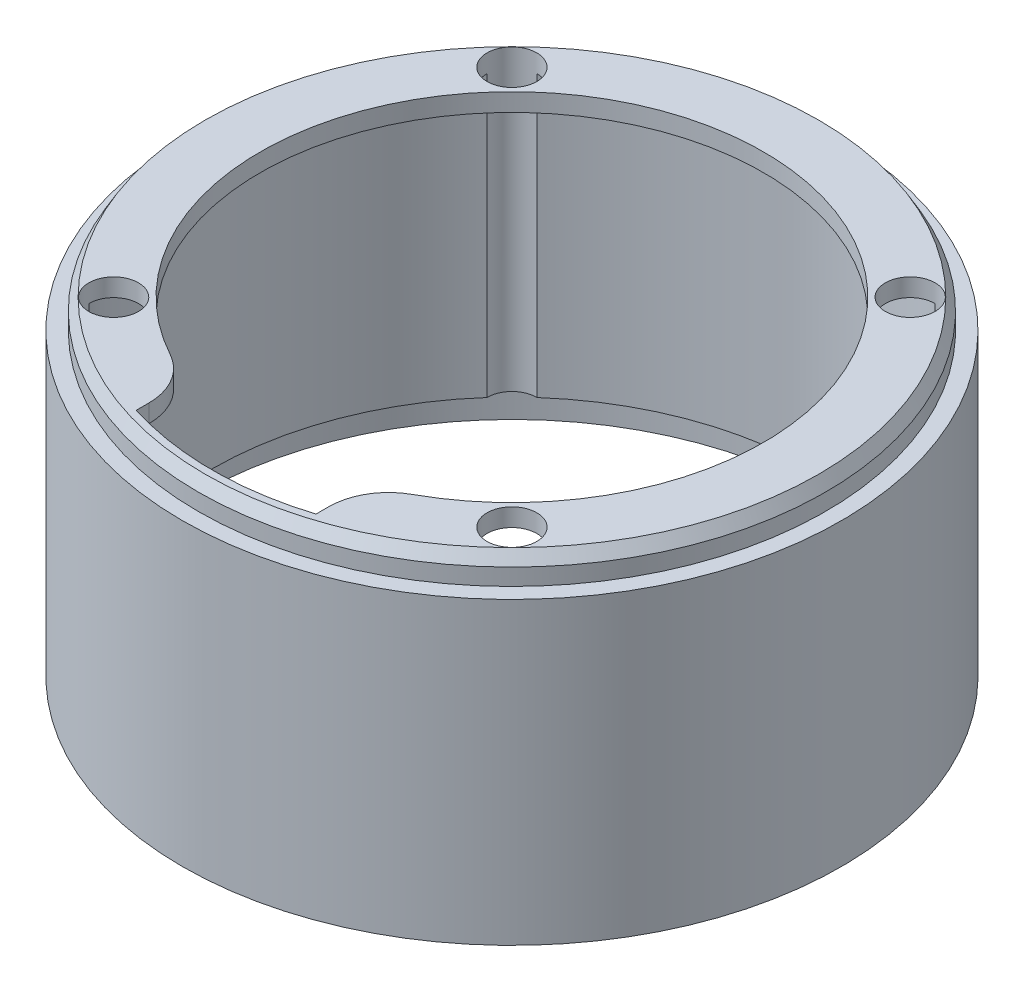
ISO-10303-21;
HEADER;
FILE_DESCRIPTION(('STEP AP214'),'2;1');
FILE_NAME('part.step','',(''),(''),'','','');
FILE_SCHEMA(('AUTOMOTIVE_DESIGN { 1 0 10303 214 1 1 1 1 }'));
ENDSEC;
DATA;
#1=APPLICATION_CONTEXT('core data for automotive mechanical design processes');
#2=APPLICATION_PROTOCOL_DEFINITION('international standard','automotive_design',2000,#1);
#3=PRODUCT_CONTEXT('',#1,'mechanical');
#4=PRODUCT('Part','Part','',(#3));
#5=PRODUCT_RELATED_PRODUCT_CATEGORY('part','',(#4));
#6=PRODUCT_DEFINITION_FORMATION('','',#4);
#7=PRODUCT_DEFINITION_CONTEXT('part definition',#1,'design');
#8=PRODUCT_DEFINITION('design','',#6,#7);
#9=PRODUCT_DEFINITION_SHAPE('','',#8);
#10=(LENGTH_UNIT() NAMED_UNIT(*) SI_UNIT(.MILLI.,.METRE.));
#11=(NAMED_UNIT(*) PLANE_ANGLE_UNIT() SI_UNIT($,.RADIAN.));
#12=(NAMED_UNIT(*) SI_UNIT($,.STERADIAN.) SOLID_ANGLE_UNIT());
#13=UNCERTAINTY_MEASURE_WITH_UNIT(LENGTH_MEASURE(1.E-05),#10,'distance_accuracy_value','');
#14=(GEOMETRIC_REPRESENTATION_CONTEXT(3) GLOBAL_UNCERTAINTY_ASSIGNED_CONTEXT((#13)) GLOBAL_UNIT_ASSIGNED_CONTEXT((#10,
#11,#12)) REPRESENTATION_CONTEXT('',''));
#15=CARTESIAN_POINT('',(0.,0.,0.));
#16=DIRECTION('',(0.,0.,1.));
#17=DIRECTION('',(1.,0.,0.));
#18=AXIS2_PLACEMENT_3D('',#15,#16,#17);
#19=CARTESIAN_POINT('',(0.,54.8,0.));
#20=DIRECTION('',(0.,-1.,0.));
#21=DIRECTION('',(0.,0.,-1.));
#22=AXIS2_PLACEMENT_3D('',#19,#20,#21);
#23=CYLINDRICAL_SURFACE('',#22,50.);
#24=DIRECTION('',(0.,1.,0.));
#25=VECTOR('',#24,1.);
#26=CARTESIAN_POINT('',(-33.203068739609,27.4,-37.383903304401));
#27=LINE('',#26,#25);
#28=CARTESIAN_POINT('',(-33.203068739609,5.00000000000001,-37.383903304401));
#29=VERTEX_POINT('',#28);
#30=CARTESIAN_POINT('',(-33.203068739609,51.8,-37.383903304401));
#31=VERTEX_POINT('',#30);
#32=EDGE_CURVE('E155',#29,#31,#27,.T.);
#33=ORIENTED_EDGE('',*,*,#32,.F.);
#34=CARTESIAN_POINT('',(0.,5.,0.));
#35=DIRECTION('',(0.,-1.,0.));
#36=DIRECTION('',(0.,0.,-1.));
#37=AXIS2_PLACEMENT_3D('',#34,#35,#36);
#38=CIRCLE('',#37,50.);
#39=CARTESIAN_POINT('',(33.203068739609,5.,-37.383903304401));
#40=VERTEX_POINT('',#39);
#41=EDGE_CURVE('E52',#29,#40,#38,.T.);
#42=ORIENTED_EDGE('',*,*,#41,.T.);
#43=DIRECTION('',(0.,1.,0.));
#44=VECTOR('',#43,1.);
#45=CARTESIAN_POINT('',(33.203068739609,27.4,-37.383903304401));
#46=LINE('',#45,#44);
#47=CARTESIAN_POINT('',(33.203068739609,51.8,-37.3839033044009));
#48=VERTEX_POINT('',#47);
#49=EDGE_CURVE('E160',#48,#40,#46,.F.);
#50=ORIENTED_EDGE('',*,*,#49,.F.);
#51=CARTESIAN_POINT('',(0.,51.8,0.));
#52=DIRECTION('',(0.,-1.,0.));
#53=DIRECTION('',(0.,0.,-1.));
#54=AXIS2_PLACEMENT_3D('',#51,#52,#53);
#55=CIRCLE('',#54,50.);
#56=EDGE_CURVE('E283',#31,#48,#55,.T.);
#57=ORIENTED_EDGE('',*,*,#56,.F.);
#58=EDGE_LOOP('',(#33,#42,#50,#57));
#59=FACE_BOUND('',#58,.T.);
#60=ADVANCED_FACE('F38',(#59),#23,.F.);
#61=DIRECTION('',(0.,1.,0.));
#62=VECTOR('',#61,1.);
#63=CARTESIAN_POINT('',(37.383903304401,27.4,-33.203068739609));
#64=LINE('',#63,#62);
#65=CARTESIAN_POINT('',(37.383903304401,5.,-33.203068739609));
#66=VERTEX_POINT('',#65);
#67=CARTESIAN_POINT('',(37.383903304401,51.8,-33.203068739609));
#68=VERTEX_POINT('',#67);
#69=EDGE_CURVE('E156',#66,#68,#64,.T.);
#70=ORIENTED_EDGE('',*,*,#69,.F.);
#71=CARTESIAN_POINT('',(0.,5.,0.));
#72=DIRECTION('',(0.,-1.,0.));
#73=DIRECTION('',(0.,0.,-1.));
#74=AXIS2_PLACEMENT_3D('',#71,#72,#73);
#75=CIRCLE('',#74,50.);
#76=CARTESIAN_POINT('',(37.383903304401,5.,33.203068739609));
#77=VERTEX_POINT('',#76);
#78=EDGE_CURVE('E315',#66,#77,#75,.T.);
#79=ORIENTED_EDGE('',*,*,#78,.T.);
#80=DIRECTION('',(0.,1.,0.));
#81=VECTOR('',#80,1.);
#82=CARTESIAN_POINT('',(37.383903304401,27.4,33.203068739609));
#83=LINE('',#82,#81);
#84=CARTESIAN_POINT('',(37.383903304401,51.8,33.203068739609));
#85=VERTEX_POINT('',#84);
#86=EDGE_CURVE('E266',#85,#77,#83,.F.);
#87=ORIENTED_EDGE('',*,*,#86,.F.);
#88=EDGE_CURVE('E290',#68,#85,#55,.T.);
#89=ORIENTED_EDGE('',*,*,#88,.F.);
#90=EDGE_LOOP('',(#70,#79,#87,#89));
#91=FACE_BOUND('',#90,.T.);
#92=ADVANCED_FACE('F362',(#91),#23,.F.);
#93=DIRECTION('',(0.,1.,0.));
#94=VECTOR('',#93,1.);
#95=CARTESIAN_POINT('',(33.203068739609,27.4,37.383903304401));
#96=LINE('',#95,#94);
#97=CARTESIAN_POINT('',(33.203068739609,5.,37.383903304401));
#98=VERTEX_POINT('',#97);
#99=CARTESIAN_POINT('',(33.203068739609,51.8,37.3839033044009));
#100=VERTEX_POINT('',#99);
#101=EDGE_CURVE('E270',#98,#100,#96,.T.);
#102=ORIENTED_EDGE('',*,*,#101,.F.);
#103=CARTESIAN_POINT('',(0.,5.,0.));
#104=DIRECTION('',(0.,-1.,0.));
#105=DIRECTION('',(0.,0.,-1.));
#106=AXIS2_PLACEMENT_3D('',#103,#104,#105);
#107=CIRCLE('',#106,50.);
#108=CARTESIAN_POINT('',(-33.203068739609,5.,37.383903304401));
#109=VERTEX_POINT('',#108);
#110=EDGE_CURVE('E318',#98,#109,#107,.T.);
#111=ORIENTED_EDGE('',*,*,#110,.T.);
#112=DIRECTION('',(0.,1.,0.));
#113=VECTOR('',#112,1.);
#114=CARTESIAN_POINT('',(-33.203068739609,27.4,37.383903304401));
#115=LINE('',#114,#113);
#116=CARTESIAN_POINT('',(-33.203068739609,51.8,37.383903304401));
#117=VERTEX_POINT('',#116);
#118=EDGE_CURVE('E166',#117,#109,#115,.F.);
#119=ORIENTED_EDGE('',*,*,#118,.F.);
#120=CARTESIAN_POINT('',(-15.,51.8,47.6969600708473));
#121=VERTEX_POINT('',#120);
#122=EDGE_CURVE('E289',#121,#117,#55,.T.);
#123=ORIENTED_EDGE('',*,*,#122,.F.);
#124=DIRECTION('',(0.,-1.,0.));
#125=VECTOR('',#124,1.);
#126=CARTESIAN_POINT('',(-15.,54.8,47.6969600708473));
#127=LINE('',#126,#125);
#128=CARTESIAN_POINT('',(-15.,54.8,47.6969600708473));
#129=VERTEX_POINT('',#128);
#130=EDGE_CURVE('E287',#129,#121,#127,.T.);
#131=ORIENTED_EDGE('',*,*,#130,.F.);
#132=CARTESIAN_POINT('',(0.,54.8,-3.9343528435154E-12));
#133=DIRECTION('',(0.,-1.,0.));
#134=DIRECTION('',(0.,0.,-1.));
#135=AXIS2_PLACEMENT_3D('',#132,#133,#134);
#136=CIRCLE('',#135,50.0000000000038);
#137=CARTESIAN_POINT('',(15.,54.8,47.6969600708473));
#138=VERTEX_POINT('',#137);
#139=EDGE_CURVE('E238',#138,#129,#136,.T.);
#140=ORIENTED_EDGE('',*,*,#139,.F.);
#141=DIRECTION('',(0.,-1.,0.));
#142=VECTOR('',#141,1.);
#143=CARTESIAN_POINT('',(15.,54.8,47.6969600708473));
#144=LINE('',#143,#142);
#145=CARTESIAN_POINT('',(15.,51.8,47.6969600708473));
#146=VERTEX_POINT('',#145);
#147=EDGE_CURVE('E240',#138,#146,#144,.T.);
#148=ORIENTED_EDGE('',*,*,#147,.T.);
#149=EDGE_CURVE('E291',#100,#146,#55,.T.);
#150=ORIENTED_EDGE('',*,*,#149,.F.);
#151=EDGE_LOOP('',(#102,#111,#119,#123,#131,#140,#148,#150));
#152=FACE_BOUND('',#151,.T.);
#153=ADVANCED_FACE('F302',(#152),#23,.F.);
#154=DIRECTION('',(0.,1.,0.));
#155=VECTOR('',#154,1.);
#156=CARTESIAN_POINT('',(-37.383903304401,27.4,33.203068739609));
#157=LINE('',#156,#155);
#158=CARTESIAN_POINT('',(-37.3839033044009,5.,33.203068739609));
#159=VERTEX_POINT('',#158);
#160=CARTESIAN_POINT('',(-37.3839033044009,51.8,33.203068739609));
#161=VERTEX_POINT('',#160);
#162=EDGE_CURVE('E148',#159,#161,#157,.T.);
#163=ORIENTED_EDGE('',*,*,#162,.F.);
#164=CARTESIAN_POINT('',(0.,5.,0.));
#165=DIRECTION('',(0.,-1.,0.));
#166=DIRECTION('',(0.,0.,-1.));
#167=AXIS2_PLACEMENT_3D('',#164,#165,#166);
#168=CIRCLE('',#167,50.);
#169=CARTESIAN_POINT('',(-37.383903304401,5.,-33.203068739609));
#170=VERTEX_POINT('',#169);
#171=EDGE_CURVE('E137',#159,#170,#168,.T.);
#172=ORIENTED_EDGE('',*,*,#171,.T.);
#173=DIRECTION('',(0.,1.,0.));
#174=VECTOR('',#173,1.);
#175=CARTESIAN_POINT('',(-37.383903304401,27.4,-33.203068739609));
#176=LINE('',#175,#174);
#177=CARTESIAN_POINT('',(-37.3839033044009,51.8,-33.203068739609));
#178=VERTEX_POINT('',#177);
#179=EDGE_CURVE('E146',#178,#170,#176,.F.);
#180=ORIENTED_EDGE('',*,*,#179,.F.);
#181=EDGE_CURVE('E286',#161,#178,#55,.T.);
#182=ORIENTED_EDGE('',*,*,#181,.F.);
#183=EDGE_LOOP('',(#163,#172,#180,#182));
#184=FACE_BOUND('',#183,.T.);
#185=ADVANCED_FACE('F144',(#184),#23,.F.);
#186=CARTESIAN_POINT('',(-33.2340187157677,0.,33.2340187157678));
#187=DIRECTION('',(0.,1.,0.));
#188=DIRECTION('',(0.,0.,1.));
#189=AXIS2_PLACEMENT_3D('',#186,#187,#188);
#190=CYLINDRICAL_SURFACE('',#189,4.15);
#191=CARTESIAN_POINT('',(-33.2340187157677,54.8,33.2340187157678));
#192=DIRECTION('',(0.,1.,0.));
#193=DIRECTION('',(0.,0.,1.));
#194=AXIS2_PLACEMENT_3D('',#191,#192,#193);
#195=CIRCLE('',#194,4.15);
#196=CARTESIAN_POINT('',(-33.2340187157677,54.8,37.3840187157678));
#197=VERTEX_POINT('',#196);
#198=EDGE_CURVE('E158',#197,#197,#195,.T.);
#199=ORIENTED_EDGE('',*,*,#198,.T.);
#200=EDGE_LOOP('',(#199));
#201=FACE_BOUND('',#200,.T.);
#202=CARTESIAN_POINT('',(-33.2340187157677,5.,33.2340187157678));
#203=DIRECTION('',(0.,-1.,0.));
#204=DIRECTION('',(0.,0.,-1.));
#205=AXIS2_PLACEMENT_3D('',#202,#203,#204);
#206=CIRCLE('',#205,4.15);
#207=EDGE_CURVE('E320',#159,#109,#206,.F.);
#208=ORIENTED_EDGE('',*,*,#207,.F.);
#209=ORIENTED_EDGE('',*,*,#162,.T.);
#210=CARTESIAN_POINT('',(-33.2340187157677,51.8,33.2340187157678));
#211=DIRECTION('',(0.,-1.,0.));
#212=DIRECTION('',(0.,0.,-1.));
#213=AXIS2_PLACEMENT_3D('',#210,#211,#212);
#214=CIRCLE('',#213,4.15);
#215=EDGE_CURVE('E257',#117,#161,#214,.F.);
#216=ORIENTED_EDGE('',*,*,#215,.F.);
#217=ORIENTED_EDGE('',*,*,#118,.T.);
#218=EDGE_LOOP('',(#208,#209,#216,#217));
#219=FACE_BOUND('',#218,.T.);
#220=ADVANCED_FACE('F370',(#201,#219),#190,.F.);
#221=CARTESIAN_POINT('',(33.2340187157678,0.,33.2340187157677));
#222=DIRECTION('',(0.,1.,0.));
#223=DIRECTION('',(0.,0.,1.));
#224=AXIS2_PLACEMENT_3D('',#221,#222,#223);
#225=CYLINDRICAL_SURFACE('',#224,4.15);
#226=CARTESIAN_POINT('',(33.2340187157678,54.8,33.2340187157677));
#227=DIRECTION('',(0.,1.,0.));
#228=DIRECTION('',(0.,0.,1.));
#229=AXIS2_PLACEMENT_3D('',#226,#227,#228);
#230=CIRCLE('',#229,4.15);
#231=CARTESIAN_POINT('',(33.2340187157678,54.8,37.3840187157677));
#232=VERTEX_POINT('',#231);
#233=EDGE_CURVE('E224',#232,#232,#230,.T.);
#234=ORIENTED_EDGE('',*,*,#233,.T.);
#235=EDGE_LOOP('',(#234));
#236=FACE_BOUND('',#235,.T.);
#237=CARTESIAN_POINT('',(33.2340187157678,5.,33.2340187157677));
#238=DIRECTION('',(0.,-1.,0.));
#239=DIRECTION('',(0.,0.,-1.));
#240=AXIS2_PLACEMENT_3D('',#237,#238,#239);
#241=CIRCLE('',#240,4.15);
#242=EDGE_CURVE('E313',#98,#77,#241,.F.);
#243=ORIENTED_EDGE('',*,*,#242,.F.);
#244=ORIENTED_EDGE('',*,*,#101,.T.);
#245=CARTESIAN_POINT('',(33.2340187157678,51.8,33.2340187157677));
#246=DIRECTION('',(0.,-1.,0.));
#247=DIRECTION('',(0.,0.,-1.));
#248=AXIS2_PLACEMENT_3D('',#245,#246,#247);
#249=CIRCLE('',#248,4.15);
#250=EDGE_CURVE('E261',#85,#100,#249,.F.);
#251=ORIENTED_EDGE('',*,*,#250,.F.);
#252=ORIENTED_EDGE('',*,*,#86,.T.);
#253=EDGE_LOOP('',(#243,#244,#251,#252));
#254=FACE_BOUND('',#253,.T.);
#255=ADVANCED_FACE('F375',(#236,#254),#225,.F.);
#256=CARTESIAN_POINT('',(33.2340187157678,0.,-33.2340187157677));
#257=DIRECTION('',(0.,1.,0.));
#258=DIRECTION('',(0.,0.,1.));
#259=AXIS2_PLACEMENT_3D('',#256,#257,#258);
#260=CYLINDRICAL_SURFACE('',#259,4.15);
#261=CARTESIAN_POINT('',(33.2340187157678,54.8,-33.2340187157677));
#262=DIRECTION('',(0.,1.,0.));
#263=DIRECTION('',(0.,0.,1.));
#264=AXIS2_PLACEMENT_3D('',#261,#262,#263);
#265=CIRCLE('',#264,4.15);
#266=CARTESIAN_POINT('',(33.2340187157678,54.8,-29.0840187157677));
#267=VERTEX_POINT('',#266);
#268=EDGE_CURVE('E228',#267,#267,#265,.T.);
#269=ORIENTED_EDGE('',*,*,#268,.T.);
#270=EDGE_LOOP('',(#269));
#271=FACE_BOUND('',#270,.T.);
#272=CARTESIAN_POINT('',(33.2340187157678,5.,-33.2340187157677));
#273=DIRECTION('',(0.,-1.,0.));
#274=DIRECTION('',(0.,0.,-1.));
#275=AXIS2_PLACEMENT_3D('',#272,#273,#274);
#276=CIRCLE('',#275,4.15);
#277=EDGE_CURVE('E276',#66,#40,#276,.F.);
#278=ORIENTED_EDGE('',*,*,#277,.F.);
#279=ORIENTED_EDGE('',*,*,#69,.T.);
#280=CARTESIAN_POINT('',(33.2340187157678,51.8,-33.2340187157677));
#281=DIRECTION('',(0.,-1.,0.));
#282=DIRECTION('',(0.,0.,-1.));
#283=AXIS2_PLACEMENT_3D('',#280,#281,#282);
#284=CIRCLE('',#283,4.15);
#285=EDGE_CURVE('E279',#48,#68,#284,.F.);
#286=ORIENTED_EDGE('',*,*,#285,.F.);
#287=ORIENTED_EDGE('',*,*,#49,.T.);
#288=EDGE_LOOP('',(#278,#279,#286,#287));
#289=FACE_BOUND('',#288,.T.);
#290=ADVANCED_FACE('F275',(#271,#289),#260,.F.);
#291=CARTESIAN_POINT('',(-33.2340187157677,0.,-33.2340187157678));
#292=DIRECTION('',(0.,1.,0.));
#293=DIRECTION('',(0.,0.,1.));
#294=AXIS2_PLACEMENT_3D('',#291,#292,#293);
#295=CYLINDRICAL_SURFACE('',#294,4.15);
#296=CARTESIAN_POINT('',(-33.2340187157677,54.8,-33.2340187157678));
#297=DIRECTION('',(0.,1.,0.));
#298=DIRECTION('',(0.,0.,1.));
#299=AXIS2_PLACEMENT_3D('',#296,#297,#298);
#300=CIRCLE('',#299,4.15);
#301=CARTESIAN_POINT('',(-33.2340187157677,54.8,-29.0840187157678));
#302=VERTEX_POINT('',#301);
#303=EDGE_CURVE('E231',#302,#302,#300,.T.);
#304=ORIENTED_EDGE('',*,*,#303,.T.);
#305=EDGE_LOOP('',(#304));
#306=FACE_BOUND('',#305,.T.);
#307=CARTESIAN_POINT('',(-33.2340187157677,5.,-33.2340187157678));
#308=DIRECTION('',(0.,-1.,0.));
#309=DIRECTION('',(0.,0.,-1.));
#310=AXIS2_PLACEMENT_3D('',#307,#308,#309);
#311=CIRCLE('',#310,4.15);
#312=EDGE_CURVE('E12',#29,#170,#311,.F.);
#313=ORIENTED_EDGE('',*,*,#312,.F.);
#314=ORIENTED_EDGE('',*,*,#32,.T.);
#315=CARTESIAN_POINT('',(-33.2340187157677,51.8,-33.2340187157678));
#316=DIRECTION('',(0.,-1.,0.));
#317=DIRECTION('',(0.,0.,-1.));
#318=AXIS2_PLACEMENT_3D('',#315,#316,#317);
#319=CIRCLE('',#318,4.15);
#320=EDGE_CURVE('E154',#178,#31,#319,.F.);
#321=ORIENTED_EDGE('',*,*,#320,.F.);
#322=ORIENTED_EDGE('',*,*,#179,.T.);
#323=EDGE_LOOP('',(#313,#314,#321,#322));
#324=FACE_BOUND('',#323,.T.);
#325=ADVANCED_FACE('F152',(#306,#324),#295,.F.);
#326=CARTESIAN_POINT('',(0.,54.8,0.));
#327=DIRECTION('',(0.,-1.,0.));
#328=DIRECTION('',(0.,0.,-1.));
#329=AXIS2_PLACEMENT_3D('',#326,#327,#328);
#330=CYLINDRICAL_SURFACE('',#329,55.);
#331=CARTESIAN_POINT('',(0.,0.,0.));
#332=DIRECTION('',(0.,1.,0.));
#333=DIRECTION('',(0.,0.,1.));
#334=AXIS2_PLACEMENT_3D('',#331,#332,#333);
#335=CIRCLE('',#334,55.);
#336=CARTESIAN_POINT('',(0.,0.,55.));
#337=VERTEX_POINT('',#336);
#338=EDGE_CURVE('E173',#337,#337,#335,.T.);
#339=ORIENTED_EDGE('',*,*,#338,.T.);
#340=EDGE_LOOP('',(#339));
#341=FACE_BOUND('',#340,.T.);
#342=CARTESIAN_POINT('',(0.,50.,0.));
#343=DIRECTION('',(0.,1.,0.));
#344=DIRECTION('',(0.,0.,1.));
#345=AXIS2_PLACEMENT_3D('',#342,#343,#344);
#346=CIRCLE('',#345,55.);
#347=CARTESIAN_POINT('',(0.,50.,55.));
#348=VERTEX_POINT('',#347);
#349=EDGE_CURVE('E197',#348,#348,#346,.T.);
#350=ORIENTED_EDGE('',*,*,#349,.F.);
#351=EDGE_LOOP('',(#350));
#352=FACE_BOUND('',#351,.T.);
#353=ADVANCED_FACE('F217',(#341,#352),#330,.T.);
#354=CARTESIAN_POINT('',(0.,54.8,0.));
#355=DIRECTION('',(0.,1.,0.));
#356=DIRECTION('',(0.,0.,1.));
#357=AXIS2_PLACEMENT_3D('',#354,#355,#356);
#358=PLANE('',#357);
#359=CARTESIAN_POINT('',(0.,54.8,0.));
#360=DIRECTION('',(0.,1.,0.));
#361=DIRECTION('',(0.,0.,1.));
#362=AXIS2_PLACEMENT_3D('',#359,#360,#361);
#363=CIRCLE('',#362,51.1952994616208);
#364=CARTESIAN_POINT('',(0.,54.8,51.1952994616208));
#365=VERTEX_POINT('',#364);
#366=EDGE_CURVE('E196',#365,#365,#363,.T.);
#367=ORIENTED_EDGE('',*,*,#366,.T.);
#368=EDGE_LOOP('',(#367));
#369=FACE_BOUND('',#368,.T.);
#370=ORIENTED_EDGE('',*,*,#198,.F.);
#371=EDGE_LOOP('',(#370));
#372=FACE_BOUND('',#371,.T.);
#373=ORIENTED_EDGE('',*,*,#233,.F.);
#374=EDGE_LOOP('',(#373));
#375=FACE_BOUND('',#374,.T.);
#376=ORIENTED_EDGE('',*,*,#268,.F.);
#377=EDGE_LOOP('',(#376));
#378=FACE_BOUND('',#377,.T.);
#379=ORIENTED_EDGE('',*,*,#303,.F.);
#380=EDGE_LOOP('',(#379));
#381=FACE_BOUND('',#380,.T.);
#382=DIRECTION('',(0.,0.,-1.));
#383=VECTOR('',#382,1.);
#384=CARTESIAN_POINT('',(-15.,54.8,33.2340187157678));
#385=LINE('',#384,#383);
#386=CARTESIAN_POINT('',(-15.,54.8,45.596052460712));
#387=VERTEX_POINT('',#386);
#388=EDGE_CURVE('E235',#129,#387,#385,.T.);
#389=ORIENTED_EDGE('',*,*,#388,.T.);
#390=CARTESIAN_POINT('',(-25.,54.8,45.596052460712));
#391=DIRECTION('',(0.,1.,0.));
#392=DIRECTION('',(0.,0.,1.));
#393=AXIS2_PLACEMENT_3D('',#390,#391,#392);
#394=CIRCLE('',#393,10.);
#395=CARTESIAN_POINT('',(-20.1923076923077,54.8,36.827580833652));
#396=VERTEX_POINT('',#395);
#397=EDGE_CURVE('E192',#387,#396,#394,.T.);
#398=ORIENTED_EDGE('',*,*,#397,.T.);
#399=CARTESIAN_POINT('',(0.,54.8,0.));
#400=DIRECTION('',(0.,1.,0.));
#401=DIRECTION('',(0.,0.,1.));
#402=AXIS2_PLACEMENT_3D('',#399,#400,#401);
#403=CIRCLE('',#402,42.);
#404=CARTESIAN_POINT('',(20.1923076923077,54.8,36.827580833652));
#405=VERTEX_POINT('',#404);
#406=EDGE_CURVE('E170',#405,#396,#403,.T.);
#407=ORIENTED_EDGE('',*,*,#406,.F.);
#408=CARTESIAN_POINT('',(25.,54.8,45.596052460712));
#409=DIRECTION('',(0.,1.,0.));
#410=DIRECTION('',(0.,0.,1.));
#411=AXIS2_PLACEMENT_3D('',#408,#409,#410);
#412=CIRCLE('',#411,10.);
#413=CARTESIAN_POINT('',(15.,54.8,45.596052460712));
#414=VERTEX_POINT('',#413);
#415=EDGE_CURVE('E60',#405,#414,#412,.T.);
#416=ORIENTED_EDGE('',*,*,#415,.T.);
#417=DIRECTION('',(0.,0.,1.));
#418=VECTOR('',#417,1.);
#419=CARTESIAN_POINT('',(15.,54.8,33.2340187157678));
#420=LINE('',#419,#418);
#421=EDGE_CURVE('E307',#414,#138,#420,.T.);
#422=ORIENTED_EDGE('',*,*,#421,.T.);
#423=ORIENTED_EDGE('',*,*,#139,.T.);
#424=EDGE_LOOP('',(#389,#398,#407,#416,#422,#423));
#425=FACE_BOUND('',#424,.T.);
#426=ADVANCED_FACE('F213',(#369,#372,#375,#378,#381,#425),#358,.T.);
#427=CARTESIAN_POINT('',(0.,0.,0.));
#428=DIRECTION('',(0.,1.,0.));
#429=DIRECTION('',(0.,0.,1.));
#430=AXIS2_PLACEMENT_3D('',#427,#428,#429);
#431=CYLINDRICAL_SURFACE('',#430,42.);
#432=ORIENTED_EDGE('',*,*,#406,.T.);
#433=DIRECTION('',(0.,1.,0.));
#434=VECTOR('',#433,1.);
#435=CARTESIAN_POINT('',(-20.1923076923077,0.,36.827580833652));
#436=LINE('',#435,#434);
#437=CARTESIAN_POINT('',(-20.1923076923077,51.8,36.827580833652));
#438=VERTEX_POINT('',#437);
#439=EDGE_CURVE('E182',#396,#438,#436,.F.);
#440=ORIENTED_EDGE('',*,*,#439,.T.);
#441=CARTESIAN_POINT('',(0.,51.8,0.));
#442=DIRECTION('',(0.,-1.,0.));
#443=DIRECTION('',(0.,0.,-1.));
#444=AXIS2_PLACEMENT_3D('',#441,#442,#443);
#445=CIRCLE('',#444,42.);
#446=CARTESIAN_POINT('',(20.1923076923077,51.8,36.827580833652));
#447=VERTEX_POINT('',#446);
#448=EDGE_CURVE('E249',#447,#438,#445,.F.);
#449=ORIENTED_EDGE('',*,*,#448,.F.);
#450=DIRECTION('',(0.,1.,0.));
#451=VECTOR('',#450,1.);
#452=CARTESIAN_POINT('',(20.1923076923077,0.,36.827580833652));
#453=LINE('',#452,#451);
#454=EDGE_CURVE('E179',#447,#405,#453,.T.);
#455=ORIENTED_EDGE('',*,*,#454,.T.);
#456=EDGE_LOOP('',(#432,#440,#449,#455));
#457=FACE_BOUND('',#456,.T.);
#458=ADVANCED_FACE('F216',(#457),#431,.F.);
#459=CARTESIAN_POINT('',(0.,0.,0.));
#460=DIRECTION('',(0.,1.,0.));
#461=DIRECTION('',(0.,0.,1.));
#462=AXIS2_PLACEMENT_3D('',#459,#460,#461);
#463=PLANE('',#462);
#464=CARTESIAN_POINT('',(0.,0.,0.));
#465=DIRECTION('',(0.,-1.,0.));
#466=DIRECTION('',(0.,0.,-1.));
#467=AXIS2_PLACEMENT_3D('',#464,#465,#466);
#468=CIRCLE('',#467,52.5);
#469=CARTESIAN_POINT('',(0.,0.,-52.5));
#470=VERTEX_POINT('',#469);
#471=EDGE_CURVE('E324',#470,#470,#468,.T.);
#472=ORIENTED_EDGE('',*,*,#471,.F.);
#473=EDGE_LOOP('',(#472));
#474=FACE_BOUND('',#473,.T.);
#475=ORIENTED_EDGE('',*,*,#338,.F.);
#476=EDGE_LOOP('',(#475));
#477=FACE_BOUND('',#476,.T.);
#478=ADVANCED_FACE('F337',(#474,#477),#463,.F.);
#479=CARTESIAN_POINT('',(0.,51.8,0.));
#480=DIRECTION('',(0.,-1.,0.));
#481=DIRECTION('',(0.,0.,-1.));
#482=AXIS2_PLACEMENT_3D('',#479,#480,#481);
#483=PLANE('',#482);
#484=ORIENTED_EDGE('',*,*,#448,.T.);
#485=CARTESIAN_POINT('',(-25.,51.8,45.596052460712));
#486=DIRECTION('',(0.,-1.,0.));
#487=DIRECTION('',(0.,0.,-1.));
#488=AXIS2_PLACEMENT_3D('',#485,#486,#487);
#489=CIRCLE('',#488,10.);
#490=CARTESIAN_POINT('',(-15.,51.8,45.596052460712));
#491=VERTEX_POINT('',#490);
#492=EDGE_CURVE('E187',#438,#491,#489,.T.);
#493=ORIENTED_EDGE('',*,*,#492,.T.);
#494=DIRECTION('',(0.,0.,-1.));
#495=VECTOR('',#494,1.);
#496=CARTESIAN_POINT('',(-15.,51.8,33.2340187157678));
#497=LINE('',#496,#495);
#498=EDGE_CURVE('E200',#121,#491,#497,.T.);
#499=ORIENTED_EDGE('',*,*,#498,.F.);
#500=ORIENTED_EDGE('',*,*,#122,.T.);
#501=ORIENTED_EDGE('',*,*,#215,.T.);
#502=ORIENTED_EDGE('',*,*,#181,.T.);
#503=ORIENTED_EDGE('',*,*,#320,.T.);
#504=ORIENTED_EDGE('',*,*,#56,.T.);
#505=ORIENTED_EDGE('',*,*,#285,.T.);
#506=ORIENTED_EDGE('',*,*,#88,.T.);
#507=ORIENTED_EDGE('',*,*,#250,.T.);
#508=ORIENTED_EDGE('',*,*,#149,.T.);
#509=DIRECTION('',(0.,0.,1.));
#510=VECTOR('',#509,1.);
#511=CARTESIAN_POINT('',(15.,51.8,0.));
#512=LINE('',#511,#510);
#513=CARTESIAN_POINT('',(15.,51.8,45.596052460712));
#514=VERTEX_POINT('',#513);
#515=EDGE_CURVE('E177',#514,#146,#512,.T.);
#516=ORIENTED_EDGE('',*,*,#515,.F.);
#517=CARTESIAN_POINT('',(25.,51.8,45.596052460712));
#518=DIRECTION('',(0.,-1.,0.));
#519=DIRECTION('',(0.,0.,-1.));
#520=AXIS2_PLACEMENT_3D('',#517,#518,#519);
#521=CIRCLE('',#520,10.);
#522=EDGE_CURVE('E185',#514,#447,#521,.T.);
#523=ORIENTED_EDGE('',*,*,#522,.T.);
#524=EDGE_LOOP('',(#484,#493,#499,#500,#501,#502,#503,#504,#505,#506,#507,#508,#516,#523));
#525=FACE_BOUND('',#524,.T.);
#526=ADVANCED_FACE('F252',(#525),#483,.T.);
#527=CARTESIAN_POINT('',(-15.,54.8,33.2340187157678));
#528=DIRECTION('',(-1.,0.,0.));
#529=DIRECTION('',(0.,0.,1.));
#530=AXIS2_PLACEMENT_3D('',#527,#528,#529);
#531=PLANE('',#530);
#532=ORIENTED_EDGE('',*,*,#498,.T.);
#533=DIRECTION('',(0.,1.,0.));
#534=VECTOR('',#533,1.);
#535=CARTESIAN_POINT('',(-15.,54.8,45.596052460712));
#536=LINE('',#535,#534);
#537=EDGE_CURVE('E189',#491,#387,#536,.T.);
#538=ORIENTED_EDGE('',*,*,#537,.T.);
#539=ORIENTED_EDGE('',*,*,#388,.F.);
#540=ORIENTED_EDGE('',*,*,#130,.T.);
#541=EDGE_LOOP('',(#532,#538,#539,#540));
#542=FACE_BOUND('',#541,.T.);
#543=ADVANCED_FACE('F447',(#542),#531,.F.);
#544=CARTESIAN_POINT('',(15.,54.8,33.2340187157678));
#545=DIRECTION('',(1.,0.,0.));
#546=DIRECTION('',(0.,0.,-1.));
#547=AXIS2_PLACEMENT_3D('',#544,#545,#546);
#548=PLANE('',#547);
#549=ORIENTED_EDGE('',*,*,#421,.F.);
#550=DIRECTION('',(0.,1.,0.));
#551=VECTOR('',#550,1.);
#552=CARTESIAN_POINT('',(15.,54.8,45.596052460712));
#553=LINE('',#552,#551);
#554=EDGE_CURVE('E194',#414,#514,#553,.F.);
#555=ORIENTED_EDGE('',*,*,#554,.T.);
#556=ORIENTED_EDGE('',*,*,#515,.T.);
#557=ORIENTED_EDGE('',*,*,#147,.F.);
#558=EDGE_LOOP('',(#549,#555,#556,#557));
#559=FACE_BOUND('',#558,.T.);
#560=ADVANCED_FACE('F438',(#559),#548,.F.);
#561=CARTESIAN_POINT('',(-25.,0.,45.596052460712));
#562=DIRECTION('',(0.,1.,0.));
#563=DIRECTION('',(0.,0.,1.));
#564=AXIS2_PLACEMENT_3D('',#561,#562,#563);
#565=CYLINDRICAL_SURFACE('',#564,10.);
#566=ORIENTED_EDGE('',*,*,#397,.F.);
#567=ORIENTED_EDGE('',*,*,#537,.F.);
#568=ORIENTED_EDGE('',*,*,#492,.F.);
#569=ORIENTED_EDGE('',*,*,#439,.F.);
#570=EDGE_LOOP('',(#566,#567,#568,#569));
#571=FACE_BOUND('',#570,.T.);
#572=ADVANCED_FACE('F245',(#571),#565,.T.);
#573=CARTESIAN_POINT('',(25.,0.,45.596052460712));
#574=DIRECTION('',(0.,1.,0.));
#575=DIRECTION('',(0.,0.,1.));
#576=AXIS2_PLACEMENT_3D('',#573,#574,#575);
#577=CYLINDRICAL_SURFACE('',#576,10.);
#578=ORIENTED_EDGE('',*,*,#522,.F.);
#579=ORIENTED_EDGE('',*,*,#554,.F.);
#580=ORIENTED_EDGE('',*,*,#415,.F.);
#581=ORIENTED_EDGE('',*,*,#454,.F.);
#582=EDGE_LOOP('',(#578,#579,#580,#581));
#583=FACE_BOUND('',#582,.T.);
#584=ADVANCED_FACE('F350',(#583),#577,.T.);
#585=CARTESIAN_POINT('',(0.,50.,0.));
#586=DIRECTION('',(0.,1.,0.));
#587=DIRECTION('',(0.,0.,1.));
#588=AXIS2_PLACEMENT_3D('',#585,#586,#587);
#589=PLANE('',#588);
#590=CARTESIAN_POINT('',(0.,50.,0.));
#591=DIRECTION('',(0.,1.,0.));
#592=DIRECTION('',(0.,0.,1.));
#593=AXIS2_PLACEMENT_3D('',#590,#591,#592);
#594=CIRCLE('',#593,52.35);
#595=CARTESIAN_POINT('',(0.,50.,52.35));
#596=VERTEX_POINT('',#595);
#597=EDGE_CURVE('E201',#596,#596,#594,.T.);
#598=ORIENTED_EDGE('',*,*,#597,.F.);
#599=EDGE_LOOP('',(#598));
#600=FACE_BOUND('',#599,.T.);
#601=ORIENTED_EDGE('',*,*,#349,.T.);
#602=EDGE_LOOP('',(#601));
#603=FACE_BOUND('',#602,.T.);
#604=ADVANCED_FACE('F348',(#600,#603),#589,.T.);
#605=CARTESIAN_POINT('',(0.,50.,0.));
#606=DIRECTION('',(0.,1.,0.));
#607=DIRECTION('',(0.,0.,1.));
#608=AXIS2_PLACEMENT_3D('',#605,#606,#607);
#609=CYLINDRICAL_SURFACE('',#608,52.35);
#610=CARTESIAN_POINT('',(0.,52.8,0.));
#611=DIRECTION('',(0.,1.,0.));
#612=DIRECTION('',(0.,0.,1.));
#613=AXIS2_PLACEMENT_3D('',#610,#611,#612);
#614=CIRCLE('',#613,52.35);
#615=CARTESIAN_POINT('',(0.,52.8,52.35));
#616=VERTEX_POINT('',#615);
#617=EDGE_CURVE('E46',#616,#616,#614,.F.);
#618=ORIENTED_EDGE('',*,*,#617,.T.);
#619=EDGE_LOOP('',(#618));
#620=FACE_BOUND('',#619,.T.);
#621=ORIENTED_EDGE('',*,*,#597,.T.);
#622=EDGE_LOOP('',(#621));
#623=FACE_BOUND('',#622,.T.);
#624=ADVANCED_FACE('F206',(#620,#623),#609,.T.);
#625=CARTESIAN_POINT('',(0.,54.8,0.));
#626=DIRECTION('',(0.,-1.,0.));
#627=DIRECTION('',(0.,0.,-1.));
#628=AXIS2_PLACEMENT_3D('',#625,#626,#627);
#629=CONICAL_SURFACE('',#628,51.1952994616208,0.523598775598293);
#630=ORIENTED_EDGE('',*,*,#617,.F.);
#631=EDGE_LOOP('',(#630));
#632=FACE_BOUND('',#631,.T.);
#633=ORIENTED_EDGE('',*,*,#366,.F.);
#634=EDGE_LOOP('',(#633));
#635=FACE_BOUND('',#634,.T.);
#636=ADVANCED_FACE('F40',(#632,#635),#629,.T.);
#637=CARTESIAN_POINT('',(0.,5.,0.));
#638=DIRECTION('',(0.,-1.,0.));
#639=DIRECTION('',(0.,0.,-1.));
#640=AXIS2_PLACEMENT_3D('',#637,#638,#639);
#641=PLANE('',#640);
#642=CARTESIAN_POINT('',(0.,5.,0.));
#643=DIRECTION('',(0.,-1.,0.));
#644=DIRECTION('',(0.,0.,-1.));
#645=AXIS2_PLACEMENT_3D('',#642,#643,#644);
#646=CIRCLE('',#645,52.5);
#647=CARTESIAN_POINT('',(0.,5.,-52.5));
#648=VERTEX_POINT('',#647);
#649=EDGE_CURVE('E149',#648,#648,#646,.T.);
#650=ORIENTED_EDGE('',*,*,#649,.T.);
#651=EDGE_LOOP('',(#650));
#652=FACE_BOUND('',#651,.T.);
#653=ORIENTED_EDGE('',*,*,#242,.T.);
#654=ORIENTED_EDGE('',*,*,#78,.F.);
#655=ORIENTED_EDGE('',*,*,#277,.T.);
#656=ORIENTED_EDGE('',*,*,#41,.F.);
#657=ORIENTED_EDGE('',*,*,#312,.T.);
#658=ORIENTED_EDGE('',*,*,#171,.F.);
#659=ORIENTED_EDGE('',*,*,#207,.T.);
#660=ORIENTED_EDGE('',*,*,#110,.F.);
#661=EDGE_LOOP('',(#653,#654,#655,#656,#657,#658,#659,#660));
#662=FACE_BOUND('',#661,.T.);
#663=ADVANCED_FACE('F136',(#652,#662),#641,.T.);
#664=CARTESIAN_POINT('',(0.,5.,0.));
#665=DIRECTION('',(0.,-1.,0.));
#666=DIRECTION('',(0.,0.,-1.));
#667=AXIS2_PLACEMENT_3D('',#664,#665,#666);
#668=CYLINDRICAL_SURFACE('',#667,52.5);
#669=ORIENTED_EDGE('',*,*,#649,.F.);
#670=EDGE_LOOP('',(#669));
#671=FACE_BOUND('',#670,.T.);
#672=ORIENTED_EDGE('',*,*,#471,.T.);
#673=EDGE_LOOP('',(#672));
#674=FACE_BOUND('',#673,.T.);
#675=ADVANCED_FACE('F331',(#671,#674),#668,.F.);
#676=CLOSED_SHELL('',(#60,#92,#153,#185,#220,#255,#290,#325,#353,#426,#458,#478,#526,#543,#560,
#572,#584,#604,#624,#636,#663,#675));
#677=MANIFOLD_SOLID_BREP('B2',#676);
#678=ADVANCED_BREP_SHAPE_REPRESENTATION('',(#18,#677),#14);
#679=SHAPE_DEFINITION_REPRESENTATION(#9,#678);
ENDSEC;
END-ISO-10303-21;
